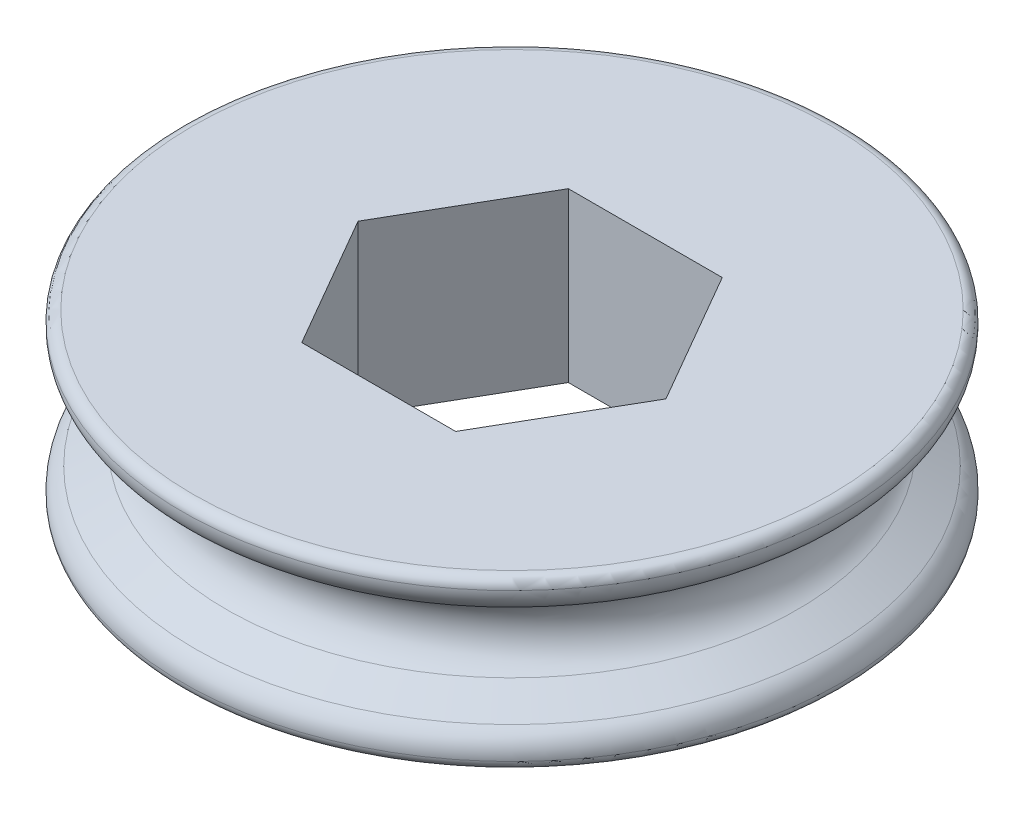
ISO-10303-21;
HEADER;
FILE_DESCRIPTION(('STEP AP214'),'2;1');
FILE_NAME('part.step','',(''),(''),'','','');
FILE_SCHEMA(('AUTOMOTIVE_DESIGN { 1 0 10303 214 1 1 1 1 }'));
ENDSEC;
DATA;
#1=APPLICATION_CONTEXT('core data for automotive mechanical design processes');
#2=APPLICATION_PROTOCOL_DEFINITION('international standard','automotive_design',2000,#1);
#3=PRODUCT_CONTEXT('',#1,'mechanical');
#4=PRODUCT('Part','Part','',(#3));
#5=PRODUCT_RELATED_PRODUCT_CATEGORY('part','',(#4));
#6=PRODUCT_DEFINITION_FORMATION('','',#4);
#7=PRODUCT_DEFINITION_CONTEXT('part definition',#1,'design');
#8=PRODUCT_DEFINITION('design','',#6,#7);
#9=PRODUCT_DEFINITION_SHAPE('','',#8);
#10=(LENGTH_UNIT() NAMED_UNIT(*) SI_UNIT(.MILLI.,.METRE.));
#11=(NAMED_UNIT(*) PLANE_ANGLE_UNIT() SI_UNIT($,.RADIAN.));
#12=(NAMED_UNIT(*) SI_UNIT($,.STERADIAN.) SOLID_ANGLE_UNIT());
#13=UNCERTAINTY_MEASURE_WITH_UNIT(LENGTH_MEASURE(1.E-05),#10,'distance_accuracy_value','');
#14=(GEOMETRIC_REPRESENTATION_CONTEXT(3) GLOBAL_UNCERTAINTY_ASSIGNED_CONTEXT((#13)) GLOBAL_UNIT_ASSIGNED_CONTEXT((#10,
#11,#12)) REPRESENTATION_CONTEXT('',''));
#15=CARTESIAN_POINT('',(0.,0.,0.));
#16=DIRECTION('',(0.,0.,1.));
#17=DIRECTION('',(1.,0.,0.));
#18=AXIS2_PLACEMENT_3D('',#15,#16,#17);
#19=CARTESIAN_POINT('',(0.,3.5000057,0.));
#20=DIRECTION('',(0.,1.,0.));
#21=DIRECTION('',(-1.,0.,0.));
#22=AXIS2_PLACEMENT_3D('',#19,#20,#21);
#23=TOROIDAL_SURFACE('',#22,15.2006219074877,0.499999000000001);
#24=CARTESIAN_POINT('',(0.,3.52503594612087,0.));
#25=DIRECTION('',(0.,1.,0.));
#26=DIRECTION('',(-1.,0.,0.));
#27=AXIS2_PLACEMENT_3D('',#24,#25,#26);
#28=CIRCLE('',#27,15.699994);
#29=CARTESIAN_POINT('',(-15.699994,3.52503594612087,0.));
#30=VERTEX_POINT('',#29);
#31=EDGE_CURVE('E11',#30,#30,#28,.T.);
#32=ORIENTED_EDGE('',*,*,#31,.T.);
#33=EDGE_LOOP('',(#32));
#34=FACE_BOUND('',#33,.T.);
#35=CARTESIAN_POINT('',(0.,4.0000047,0.));
#36=DIRECTION('',(0.,1.,0.));
#37=DIRECTION('',(-1.,0.,0.));
#38=AXIS2_PLACEMENT_3D('',#35,#36,#37);
#39=CIRCLE('',#38,15.2006219074877);
#40=CARTESIAN_POINT('',(-15.2006219074877,4.0000047,0.));
#41=VERTEX_POINT('',#40);
#42=EDGE_CURVE('E130',#41,#41,#39,.T.);
#43=ORIENTED_EDGE('',*,*,#42,.F.);
#44=EDGE_LOOP('',(#43));
#45=FACE_BOUND('',#44,.T.);
#46=ADVANCED_FACE('F33',(#34,#45),#23,.T.);
#47=CARTESIAN_POINT('',(0.,3.46496335543078,0.));
#48=DIRECTION('',(0.,1.,0.));
#49=DIRECTION('',(-1.,0.,0.));
#50=AXIS2_PLACEMENT_3D('',#47,#48,#49);
#51=TOROIDAL_SURFACE('',#50,14.5015009779704,1.1999976);
#52=CARTESIAN_POINT('',(0.,2.42573494935043,0.));
#53=DIRECTION('',(0.,1.,0.));
#54=DIRECTION('',(-1.,0.,0.));
#55=AXIS2_PLACEMENT_3D('',#52,#53,#54);
#56=CIRCLE('',#55,15.1014997779704);
#57=CARTESIAN_POINT('',(-15.1014997779704,2.42573494935042,0.));
#58=VERTEX_POINT('',#57);
#59=EDGE_CURVE('E40',#58,#58,#56,.T.);
#60=ORIENTED_EDGE('',*,*,#59,.T.);
#61=EDGE_LOOP('',(#60));
#62=FACE_BOUND('',#61,.T.);
#63=ORIENTED_EDGE('',*,*,#31,.F.);
#64=EDGE_LOOP('',(#63));
#65=FACE_BOUND('',#64,.T.);
#66=ADVANCED_FACE('F157',(#62,#65),#51,.T.);
#67=CARTESIAN_POINT('',(0.,2.42573494935043,0.));
#68=DIRECTION('',(0.,1.,0.));
#69=DIRECTION('',(-1.,0.,0.));
#70=AXIS2_PLACEMENT_3D('',#67,#68,#69);
#71=CONICAL_SURFACE('',#70,15.1014997779704,1.0471975511966);
#72=CARTESIAN_POINT('',(0.,1.55884260912054,0.));
#73=DIRECTION('',(0.,1.,0.));
#74=DIRECTION('',(-1.,0.,0.));
#75=AXIS2_PLACEMENT_3D('',#72,#73,#74);
#76=CIRCLE('',#75,13.5999982);
#77=CARTESIAN_POINT('',(-13.5999982,1.55884260912053,0.));
#78=VERTEX_POINT('',#77);
#79=EDGE_CURVE('E152',#78,#78,#76,.T.);
#80=ORIENTED_EDGE('',*,*,#79,.T.);
#81=EDGE_LOOP('',(#80));
#82=FACE_BOUND('',#81,.T.);
#83=ORIENTED_EDGE('',*,*,#59,.F.);
#84=EDGE_LOOP('',(#83));
#85=FACE_BOUND('',#84,.T.);
#86=ADVANCED_FACE('F160',(#82,#85),#71,.T.);
#87=CARTESIAN_POINT('',(0.,0.,0.));
#88=DIRECTION('',(0.,1.,0.));
#89=DIRECTION('',(-1.,0.,0.));
#90=AXIS2_PLACEMENT_3D('',#87,#88,#89);
#91=TOROIDAL_SURFACE('',#90,14.4999964,1.7999964);
#92=CARTESIAN_POINT('',(0.,-1.55884260912053,0.));
#93=DIRECTION('',(0.,1.,0.));
#94=DIRECTION('',(-1.,0.,0.));
#95=AXIS2_PLACEMENT_3D('',#92,#93,#94);
#96=CIRCLE('',#95,13.5999982);
#97=CARTESIAN_POINT('',(-13.5999982,-1.55884260912053,0.));
#98=VERTEX_POINT('',#97);
#99=EDGE_CURVE('E149',#98,#98,#96,.T.);
#100=ORIENTED_EDGE('',*,*,#99,.T.);
#101=EDGE_LOOP('',(#100));
#102=FACE_BOUND('',#101,.T.);
#103=ORIENTED_EDGE('',*,*,#79,.F.);
#104=EDGE_LOOP('',(#103));
#105=FACE_BOUND('',#104,.T.);
#106=ADVANCED_FACE('F162',(#102,#105),#91,.F.);
#107=CARTESIAN_POINT('',(0.,-1.55884260912053,0.));
#108=DIRECTION('',(0.,-1.,0.));
#109=DIRECTION('',(1.,0.,0.));
#110=AXIS2_PLACEMENT_3D('',#107,#108,#109);
#111=CONICAL_SURFACE('',#110,13.5999982,1.0471975511966);
#112=CARTESIAN_POINT('',(0.,-2.42573494935042,0.));
#113=DIRECTION('',(0.,1.,0.));
#114=DIRECTION('',(-1.,0.,0.));
#115=AXIS2_PLACEMENT_3D('',#112,#113,#114);
#116=CIRCLE('',#115,15.1014997779704);
#117=CARTESIAN_POINT('',(-15.1014997779704,-2.42573494935042,0.));
#118=VERTEX_POINT('',#117);
#119=EDGE_CURVE('E146',#118,#118,#116,.T.);
#120=ORIENTED_EDGE('',*,*,#119,.T.);
#121=EDGE_LOOP('',(#120));
#122=FACE_BOUND('',#121,.T.);
#123=ORIENTED_EDGE('',*,*,#99,.F.);
#124=EDGE_LOOP('',(#123));
#125=FACE_BOUND('',#124,.T.);
#126=ADVANCED_FACE('F169',(#122,#125),#111,.T.);
#127=CARTESIAN_POINT('',(0.,-3.46496335543078,0.));
#128=DIRECTION('',(0.,1.,0.));
#129=DIRECTION('',(-1.,0.,0.));
#130=AXIS2_PLACEMENT_3D('',#127,#128,#129);
#131=TOROIDAL_SURFACE('',#130,14.5015009779704,1.1999976);
#132=CARTESIAN_POINT('',(0.,-3.52503594612087,0.));
#133=DIRECTION('',(0.,1.,0.));
#134=DIRECTION('',(-1.,0.,0.));
#135=AXIS2_PLACEMENT_3D('',#132,#133,#134);
#136=CIRCLE('',#135,15.699994);
#137=CARTESIAN_POINT('',(-15.699994,-3.52503594612087,0.));
#138=VERTEX_POINT('',#137);
#139=EDGE_CURVE('E143',#138,#138,#136,.T.);
#140=ORIENTED_EDGE('',*,*,#139,.T.);
#141=EDGE_LOOP('',(#140));
#142=FACE_BOUND('',#141,.T.);
#143=ORIENTED_EDGE('',*,*,#119,.F.);
#144=EDGE_LOOP('',(#143));
#145=FACE_BOUND('',#144,.T.);
#146=ADVANCED_FACE('F195',(#142,#145),#131,.T.);
#147=CARTESIAN_POINT('',(0.,-3.5000057,0.));
#148=DIRECTION('',(0.,1.,0.));
#149=DIRECTION('',(-1.,0.,0.));
#150=AXIS2_PLACEMENT_3D('',#147,#148,#149);
#151=TOROIDAL_SURFACE('',#150,15.2006219074877,0.499999000000001);
#152=CARTESIAN_POINT('',(0.,-4.0000047,0.));
#153=DIRECTION('',(0.,1.,0.));
#154=DIRECTION('',(-1.,0.,0.));
#155=AXIS2_PLACEMENT_3D('',#152,#153,#154);
#156=CIRCLE('',#155,15.2006219074877);
#157=CARTESIAN_POINT('',(-15.2006219074877,-4.0000047,0.));
#158=VERTEX_POINT('',#157);
#159=EDGE_CURVE('E140',#158,#158,#156,.T.);
#160=ORIENTED_EDGE('',*,*,#159,.T.);
#161=EDGE_LOOP('',(#160));
#162=FACE_BOUND('',#161,.T.);
#163=ORIENTED_EDGE('',*,*,#139,.F.);
#164=EDGE_LOOP('',(#163));
#165=FACE_BOUND('',#164,.T.);
#166=ADVANCED_FACE('F188',(#162,#165),#151,.T.);
#167=CARTESIAN_POINT('',(0.,-4.0000047,0.));
#168=DIRECTION('',(0.,-1.,0.));
#169=DIRECTION('',(1.,0.,0.));
#170=AXIS2_PLACEMENT_3D('',#167,#168,#169);
#171=PLANE('',#170);
#172=DIRECTION('',(0.5,0.,0.866025403784439));
#173=VECTOR('',#172,1.);
#174=CARTESIAN_POINT('',(3.66617420935412,-4.0000047,-6.35));
#175=LINE('',#174,#173);
#176=CARTESIAN_POINT('',(3.66617420935412,-4.0000047,-6.35));
#177=VERTEX_POINT('',#176);
#178=CARTESIAN_POINT('',(7.33234841870825,-4.0000047,0.));
#179=VERTEX_POINT('',#178);
#180=EDGE_CURVE('E47',#177,#179,#175,.T.);
#181=ORIENTED_EDGE('',*,*,#180,.F.);
#182=DIRECTION('',(1.,0.,0.));
#183=VECTOR('',#182,1.);
#184=CARTESIAN_POINT('',(-3.66617420935413,-4.0000047,-6.35));
#185=LINE('',#184,#183);
#186=CARTESIAN_POINT('',(-3.66617420935413,-4.0000047,-6.35));
#187=VERTEX_POINT('',#186);
#188=EDGE_CURVE('E104',#187,#177,#185,.T.);
#189=ORIENTED_EDGE('',*,*,#188,.F.);
#190=DIRECTION('',(0.5,0.,-0.866025403784439));
#191=VECTOR('',#190,1.);
#192=CARTESIAN_POINT('',(-7.33234841870825,-4.0000047,0.));
#193=LINE('',#192,#191);
#194=CARTESIAN_POINT('',(-7.33234841870825,-4.0000047,0.));
#195=VERTEX_POINT('',#194);
#196=EDGE_CURVE('E107',#195,#187,#193,.T.);
#197=ORIENTED_EDGE('',*,*,#196,.F.);
#198=DIRECTION('',(-0.5,0.,-0.866025403784438));
#199=VECTOR('',#198,1.);
#200=CARTESIAN_POINT('',(-3.66617420935412,-4.0000047,6.35));
#201=LINE('',#200,#199);
#202=CARTESIAN_POINT('',(-3.66617420935412,-4.0000047,6.35));
#203=VERTEX_POINT('',#202);
#204=EDGE_CURVE('E123',#203,#195,#201,.T.);
#205=ORIENTED_EDGE('',*,*,#204,.F.);
#206=DIRECTION('',(-1.,0.,0.));
#207=VECTOR('',#206,1.);
#208=CARTESIAN_POINT('',(3.66617420935412,-4.0000047,6.35));
#209=LINE('',#208,#207);
#210=CARTESIAN_POINT('',(3.66617420935412,-4.0000047,6.35));
#211=VERTEX_POINT('',#210);
#212=EDGE_CURVE('E120',#211,#203,#209,.T.);
#213=ORIENTED_EDGE('',*,*,#212,.F.);
#214=DIRECTION('',(-0.5,0.,0.866025403784439));
#215=VECTOR('',#214,1.);
#216=CARTESIAN_POINT('',(7.33234841870825,-4.0000047,0.));
#217=LINE('',#216,#215);
#218=EDGE_CURVE('E118',#179,#211,#217,.T.);
#219=ORIENTED_EDGE('',*,*,#218,.F.);
#220=EDGE_LOOP('',(#181,#189,#197,#205,#213,#219));
#221=FACE_BOUND('',#220,.T.);
#222=ORIENTED_EDGE('',*,*,#159,.F.);
#223=EDGE_LOOP('',(#222));
#224=FACE_BOUND('',#223,.T.);
#225=ADVANCED_FACE('F180',(#221,#224),#171,.T.);
#226=CARTESIAN_POINT('',(0.,4.0000047,0.));
#227=DIRECTION('',(0.,1.,0.));
#228=DIRECTION('',(-1.,0.,0.));
#229=AXIS2_PLACEMENT_3D('',#226,#227,#228);
#230=PLANE('',#229);
#231=DIRECTION('',(0.5,0.,0.866025403784439));
#232=VECTOR('',#231,1.);
#233=CARTESIAN_POINT('',(3.66617420935412,4.0000047,-6.35000000000001));
#234=LINE('',#233,#232);
#235=CARTESIAN_POINT('',(3.66617420935412,4.0000047,-6.35000000000001));
#236=VERTEX_POINT('',#235);
#237=CARTESIAN_POINT('',(7.33234841870825,4.0000047,0.));
#238=VERTEX_POINT('',#237);
#239=EDGE_CURVE('E87',#236,#238,#234,.T.);
#240=ORIENTED_EDGE('',*,*,#239,.T.);
#241=DIRECTION('',(-0.5,0.,0.866025403784439));
#242=VECTOR('',#241,1.);
#243=CARTESIAN_POINT('',(7.33234841870825,4.0000047,0.));
#244=LINE('',#243,#242);
#245=CARTESIAN_POINT('',(3.66617420935412,4.0000047,6.35));
#246=VERTEX_POINT('',#245);
#247=EDGE_CURVE('E96',#238,#246,#244,.T.);
#248=ORIENTED_EDGE('',*,*,#247,.T.);
#249=DIRECTION('',(-1.,0.,0.));
#250=VECTOR('',#249,1.);
#251=CARTESIAN_POINT('',(3.66617420935412,4.0000047,6.35));
#252=LINE('',#251,#250);
#253=CARTESIAN_POINT('',(-3.66617420935412,4.0000047,6.35));
#254=VERTEX_POINT('',#253);
#255=EDGE_CURVE('E55',#246,#254,#252,.T.);
#256=ORIENTED_EDGE('',*,*,#255,.T.);
#257=DIRECTION('',(-0.5,0.,-0.866025403784438));
#258=VECTOR('',#257,1.);
#259=CARTESIAN_POINT('',(-3.66617420935412,4.0000047,6.35));
#260=LINE('',#259,#258);
#261=CARTESIAN_POINT('',(-7.33234841870825,4.0000047,0.));
#262=VERTEX_POINT('',#261);
#263=EDGE_CURVE('E111',#254,#262,#260,.T.);
#264=ORIENTED_EDGE('',*,*,#263,.T.);
#265=DIRECTION('',(0.5,0.,-0.866025403784439));
#266=VECTOR('',#265,1.);
#267=CARTESIAN_POINT('',(-7.33234841870825,4.0000047,0.));
#268=LINE('',#267,#266);
#269=CARTESIAN_POINT('',(-3.66617420935413,4.0000047,-6.35));
#270=VERTEX_POINT('',#269);
#271=EDGE_CURVE('E114',#262,#270,#268,.T.);
#272=ORIENTED_EDGE('',*,*,#271,.T.);
#273=DIRECTION('',(1.,0.,0.));
#274=VECTOR('',#273,1.);
#275=CARTESIAN_POINT('',(-3.66617420935413,4.0000047,-6.35));
#276=LINE('',#275,#274);
#277=EDGE_CURVE('E93',#270,#236,#276,.T.);
#278=ORIENTED_EDGE('',*,*,#277,.T.);
#279=EDGE_LOOP('',(#240,#248,#256,#264,#272,#278));
#280=FACE_BOUND('',#279,.T.);
#281=ORIENTED_EDGE('',*,*,#42,.T.);
#282=EDGE_LOOP('',(#281));
#283=FACE_BOUND('',#282,.T.);
#284=ADVANCED_FACE('F100',(#280,#283),#230,.T.);
#285=CARTESIAN_POINT('',(3.66617420935412,4.0000047,-6.35000000000001));
#286=DIRECTION('',(0.866025403784439,0.,-0.5));
#287=DIRECTION('',(-0.5,0.,-0.866025403784439));
#288=AXIS2_PLACEMENT_3D('',#285,#286,#287);
#289=PLANE('',#288);
#290=ORIENTED_EDGE('',*,*,#180,.T.);
#291=DIRECTION('',(0.,-1.,0.));
#292=VECTOR('',#291,1.);
#293=CARTESIAN_POINT('',(7.33234841870825,4.0000047,0.));
#294=LINE('',#293,#292);
#295=EDGE_CURVE('E83',#238,#179,#294,.T.);
#296=ORIENTED_EDGE('',*,*,#295,.F.);
#297=ORIENTED_EDGE('',*,*,#239,.F.);
#298=DIRECTION('',(0.,-1.,0.));
#299=VECTOR('',#298,1.);
#300=CARTESIAN_POINT('',(3.66617420935412,4.0000047,-6.35000000000001));
#301=LINE('',#300,#299);
#302=EDGE_CURVE('E128',#236,#177,#301,.T.);
#303=ORIENTED_EDGE('',*,*,#302,.T.);
#304=EDGE_LOOP('',(#290,#296,#297,#303));
#305=FACE_BOUND('',#304,.T.);
#306=ADVANCED_FACE('F85',(#305),#289,.F.);
#307=CARTESIAN_POINT('',(-3.66617420935413,4.0000047,-6.35));
#308=DIRECTION('',(0.,0.,-1.));
#309=DIRECTION('',(-1.,0.,0.));
#310=AXIS2_PLACEMENT_3D('',#307,#308,#309);
#311=PLANE('',#310);
#312=ORIENTED_EDGE('',*,*,#188,.T.);
#313=ORIENTED_EDGE('',*,*,#302,.F.);
#314=ORIENTED_EDGE('',*,*,#277,.F.);
#315=DIRECTION('',(0.,-1.,0.));
#316=VECTOR('',#315,1.);
#317=CARTESIAN_POINT('',(-3.66617420935413,4.0000047,-6.35));
#318=LINE('',#317,#316);
#319=EDGE_CURVE('E131',#270,#187,#318,.T.);
#320=ORIENTED_EDGE('',*,*,#319,.T.);
#321=EDGE_LOOP('',(#312,#313,#314,#320));
#322=FACE_BOUND('',#321,.T.);
#323=ADVANCED_FACE('F186',(#322),#311,.F.);
#324=CARTESIAN_POINT('',(-7.33234841870825,4.0000047,0.));
#325=DIRECTION('',(-0.866025403784439,0.,-0.5));
#326=DIRECTION('',(-0.5,0.,0.866025403784439));
#327=AXIS2_PLACEMENT_3D('',#324,#325,#326);
#328=PLANE('',#327);
#329=ORIENTED_EDGE('',*,*,#196,.T.);
#330=ORIENTED_EDGE('',*,*,#319,.F.);
#331=ORIENTED_EDGE('',*,*,#271,.F.);
#332=DIRECTION('',(0.,-1.,0.));
#333=VECTOR('',#332,1.);
#334=CARTESIAN_POINT('',(-7.33234841870825,4.0000047,0.));
#335=LINE('',#334,#333);
#336=EDGE_CURVE('E133',#262,#195,#335,.T.);
#337=ORIENTED_EDGE('',*,*,#336,.T.);
#338=EDGE_LOOP('',(#329,#330,#331,#337));
#339=FACE_BOUND('',#338,.T.);
#340=ADVANCED_FACE('F243',(#339),#328,.F.);
#341=CARTESIAN_POINT('',(-3.66617420935412,4.0000047,6.35));
#342=DIRECTION('',(-0.866025403784438,0.,0.5));
#343=DIRECTION('',(0.5,0.,0.866025403784439));
#344=AXIS2_PLACEMENT_3D('',#341,#342,#343);
#345=PLANE('',#344);
#346=ORIENTED_EDGE('',*,*,#204,.T.);
#347=ORIENTED_EDGE('',*,*,#336,.F.);
#348=ORIENTED_EDGE('',*,*,#263,.F.);
#349=DIRECTION('',(0.,-1.,0.));
#350=VECTOR('',#349,1.);
#351=CARTESIAN_POINT('',(-3.66617420935412,4.0000047,6.35));
#352=LINE('',#351,#350);
#353=EDGE_CURVE('E135',#254,#203,#352,.T.);
#354=ORIENTED_EDGE('',*,*,#353,.T.);
#355=EDGE_LOOP('',(#346,#347,#348,#354));
#356=FACE_BOUND('',#355,.T.);
#357=ADVANCED_FACE('F253',(#356),#345,.F.);
#358=CARTESIAN_POINT('',(3.66617420935412,4.0000047,6.35));
#359=DIRECTION('',(0.,0.,1.));
#360=DIRECTION('',(1.,0.,0.));
#361=AXIS2_PLACEMENT_3D('',#358,#359,#360);
#362=PLANE('',#361);
#363=ORIENTED_EDGE('',*,*,#212,.T.);
#364=ORIENTED_EDGE('',*,*,#353,.F.);
#365=ORIENTED_EDGE('',*,*,#255,.F.);
#366=DIRECTION('',(0.,-1.,0.));
#367=VECTOR('',#366,1.);
#368=CARTESIAN_POINT('',(3.66617420935412,4.0000047,6.35));
#369=LINE('',#368,#367);
#370=EDGE_CURVE('E92',#246,#211,#369,.T.);
#371=ORIENTED_EDGE('',*,*,#370,.T.);
#372=EDGE_LOOP('',(#363,#364,#365,#371));
#373=FACE_BOUND('',#372,.T.);
#374=ADVANCED_FACE('F263',(#373),#362,.F.);
#375=CARTESIAN_POINT('',(7.33234841870825,4.0000047,0.));
#376=DIRECTION('',(0.866025403784439,0.,0.5));
#377=DIRECTION('',(0.5,0.,-0.866025403784439));
#378=AXIS2_PLACEMENT_3D('',#375,#376,#377);
#379=PLANE('',#378);
#380=ORIENTED_EDGE('',*,*,#218,.T.);
#381=ORIENTED_EDGE('',*,*,#370,.F.);
#382=ORIENTED_EDGE('',*,*,#247,.F.);
#383=ORIENTED_EDGE('',*,*,#295,.T.);
#384=EDGE_LOOP('',(#380,#381,#382,#383));
#385=FACE_BOUND('',#384,.T.);
#386=ADVANCED_FACE('F97',(#385),#379,.F.);
#387=CLOSED_SHELL('',(#46,#66,#86,#106,#126,#146,#166,#225,#284,#306,#323,#340,#357,#374,#386));
#388=MANIFOLD_SOLID_BREP('B2',#387);
#389=ADVANCED_BREP_SHAPE_REPRESENTATION('',(#18,#388),#14);
#390=SHAPE_DEFINITION_REPRESENTATION(#9,#389);
ENDSEC;
END-ISO-10303-21;
